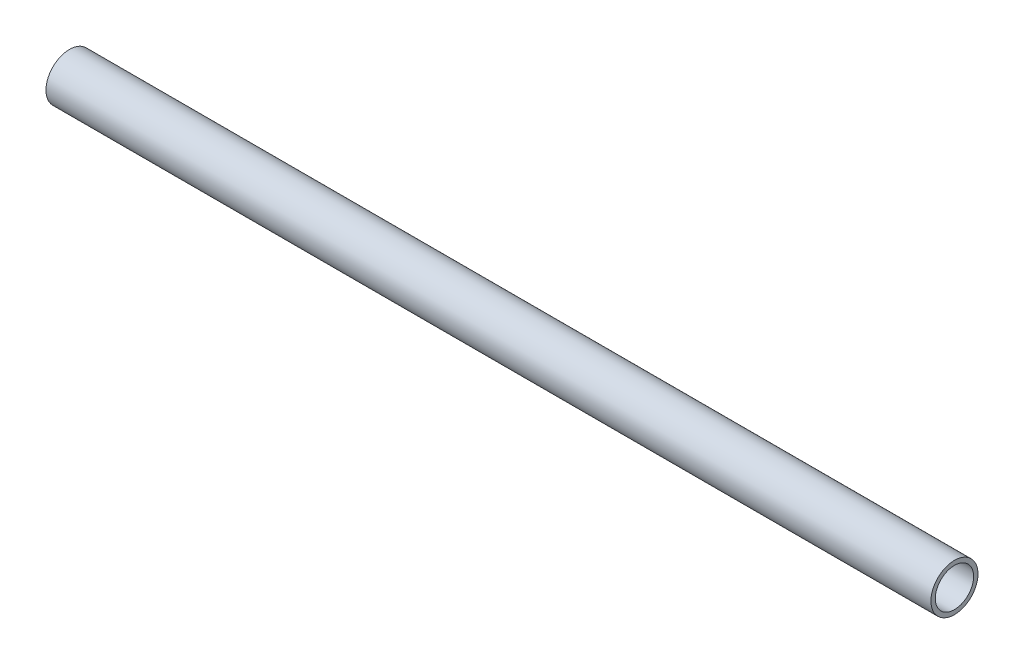
ISO-10303-21;
HEADER;
FILE_DESCRIPTION(('STEP AP214'),'2;1');
FILE_NAME('part.step','',(''),(''),'','','');
FILE_SCHEMA(('AUTOMOTIVE_DESIGN { 1 0 10303 214 1 1 1 1 }'));
ENDSEC;
DATA;
#1=APPLICATION_CONTEXT('core data for automotive mechanical design processes');
#2=APPLICATION_PROTOCOL_DEFINITION('international standard','automotive_design',2000,#1);
#3=PRODUCT_CONTEXT('',#1,'mechanical');
#4=PRODUCT('Part','Part','',(#3));
#5=PRODUCT_RELATED_PRODUCT_CATEGORY('part','',(#4));
#6=PRODUCT_DEFINITION_FORMATION('','',#4);
#7=PRODUCT_DEFINITION_CONTEXT('part definition',#1,'design');
#8=PRODUCT_DEFINITION('design','',#6,#7);
#9=PRODUCT_DEFINITION_SHAPE('','',#8);
#10=(LENGTH_UNIT() NAMED_UNIT(*) SI_UNIT(.MILLI.,.METRE.));
#11=(NAMED_UNIT(*) PLANE_ANGLE_UNIT() SI_UNIT($,.RADIAN.));
#12=(NAMED_UNIT(*) SI_UNIT($,.STERADIAN.) SOLID_ANGLE_UNIT());
#13=UNCERTAINTY_MEASURE_WITH_UNIT(LENGTH_MEASURE(1.E-05),#10,'distance_accuracy_value','');
#14=(GEOMETRIC_REPRESENTATION_CONTEXT(3) GLOBAL_UNCERTAINTY_ASSIGNED_CONTEXT((#13)) GLOBAL_UNIT_ASSIGNED_CONTEXT((#10,
#11,#12)) REPRESENTATION_CONTEXT('',''));
#15=CARTESIAN_POINT('',(0.,0.,0.));
#16=DIRECTION('',(0.,0.,1.));
#17=DIRECTION('',(1.,0.,0.));
#18=AXIS2_PLACEMENT_3D('',#15,#16,#17);
#19=CARTESIAN_POINT('',(298.45,0.,0.));
#20=DIRECTION('',(-1.,0.,0.));
#21=DIRECTION('',(0.,0.,1.));
#22=AXIS2_PLACEMENT_3D('',#19,#20,#21);
#23=CYLINDRICAL_SURFACE('',#22,6.4643);
#24=CARTESIAN_POINT('',(298.45,0.,0.));
#25=DIRECTION('',(1.,0.,0.));
#26=DIRECTION('',(0.,0.,-1.));
#27=AXIS2_PLACEMENT_3D('',#24,#25,#26);
#28=CIRCLE('',#27,6.4643);
#29=CARTESIAN_POINT('',(298.45,0.,-6.4643));
#30=VERTEX_POINT('',#29);
#31=EDGE_CURVE('E45',#30,#30,#28,.T.);
#32=ORIENTED_EDGE('',*,*,#31,.T.);
#33=EDGE_LOOP('',(#32));
#34=FACE_BOUND('',#33,.T.);
#35=CARTESIAN_POINT('',(0.,0.,0.));
#36=DIRECTION('',(1.,0.,0.));
#37=DIRECTION('',(0.,0.,-1.));
#38=AXIS2_PLACEMENT_3D('',#35,#36,#37);
#39=CIRCLE('',#38,6.4643);
#40=CARTESIAN_POINT('',(0.,0.,-6.4643));
#41=VERTEX_POINT('',#40);
#42=EDGE_CURVE('E51',#41,#41,#39,.T.);
#43=ORIENTED_EDGE('',*,*,#42,.F.);
#44=EDGE_LOOP('',(#43));
#45=FACE_BOUND('',#44,.T.);
#46=ADVANCED_FACE('F38',(#34,#45),#23,.F.);
#47=CARTESIAN_POINT('',(298.45,0.,0.));
#48=DIRECTION('',(-1.,0.,0.));
#49=DIRECTION('',(0.,0.,1.));
#50=AXIS2_PLACEMENT_3D('',#47,#48,#49);
#51=CYLINDRICAL_SURFACE('',#50,7.9375);
#52=CARTESIAN_POINT('',(298.45,0.,0.));
#53=DIRECTION('',(1.,0.,0.));
#54=DIRECTION('',(0.,0.,-1.));
#55=AXIS2_PLACEMENT_3D('',#52,#53,#54);
#56=CIRCLE('',#55,7.9375);
#57=CARTESIAN_POINT('',(298.45,0.,-7.9375));
#58=VERTEX_POINT('',#57);
#59=EDGE_CURVE('E11',#58,#58,#56,.T.);
#60=ORIENTED_EDGE('',*,*,#59,.F.);
#61=EDGE_LOOP('',(#60));
#62=FACE_BOUND('',#61,.T.);
#63=CARTESIAN_POINT('',(0.,0.,0.));
#64=DIRECTION('',(1.,0.,0.));
#65=DIRECTION('',(0.,0.,-1.));
#66=AXIS2_PLACEMENT_3D('',#63,#64,#65);
#67=CIRCLE('',#66,7.9375);
#68=CARTESIAN_POINT('',(0.,0.,-7.9375));
#69=VERTEX_POINT('',#68);
#70=EDGE_CURVE('E41',#69,#69,#67,.T.);
#71=ORIENTED_EDGE('',*,*,#70,.T.);
#72=EDGE_LOOP('',(#71));
#73=FACE_BOUND('',#72,.T.);
#74=ADVANCED_FACE('F58',(#62,#73),#51,.T.);
#75=CARTESIAN_POINT('',(298.45,0.,0.));
#76=DIRECTION('',(1.,0.,0.));
#77=DIRECTION('',(0.,0.,-1.));
#78=AXIS2_PLACEMENT_3D('',#75,#76,#77);
#79=PLANE('',#78);
#80=ORIENTED_EDGE('',*,*,#31,.F.);
#81=EDGE_LOOP('',(#80));
#82=FACE_BOUND('',#81,.T.);
#83=ORIENTED_EDGE('',*,*,#59,.T.);
#84=EDGE_LOOP('',(#83));
#85=FACE_BOUND('',#84,.T.);
#86=ADVANCED_FACE('F62',(#82,#85),#79,.T.);
#87=CARTESIAN_POINT('',(0.,0.,0.));
#88=DIRECTION('',(1.,0.,0.));
#89=DIRECTION('',(0.,0.,-1.));
#90=AXIS2_PLACEMENT_3D('',#87,#88,#89);
#91=PLANE('',#90);
#92=ORIENTED_EDGE('',*,*,#42,.T.);
#93=EDGE_LOOP('',(#92));
#94=FACE_BOUND('',#93,.T.);
#95=ORIENTED_EDGE('',*,*,#70,.F.);
#96=EDGE_LOOP('',(#95));
#97=FACE_BOUND('',#96,.T.);
#98=ADVANCED_FACE('F60',(#94,#97),#91,.F.);
#99=CLOSED_SHELL('',(#46,#74,#86,#98));
#100=MANIFOLD_SOLID_BREP('B2',#99);
#101=ADVANCED_BREP_SHAPE_REPRESENTATION('',(#18,#100),#14);
#102=SHAPE_DEFINITION_REPRESENTATION(#9,#101);
ENDSEC;
END-ISO-10303-21;
